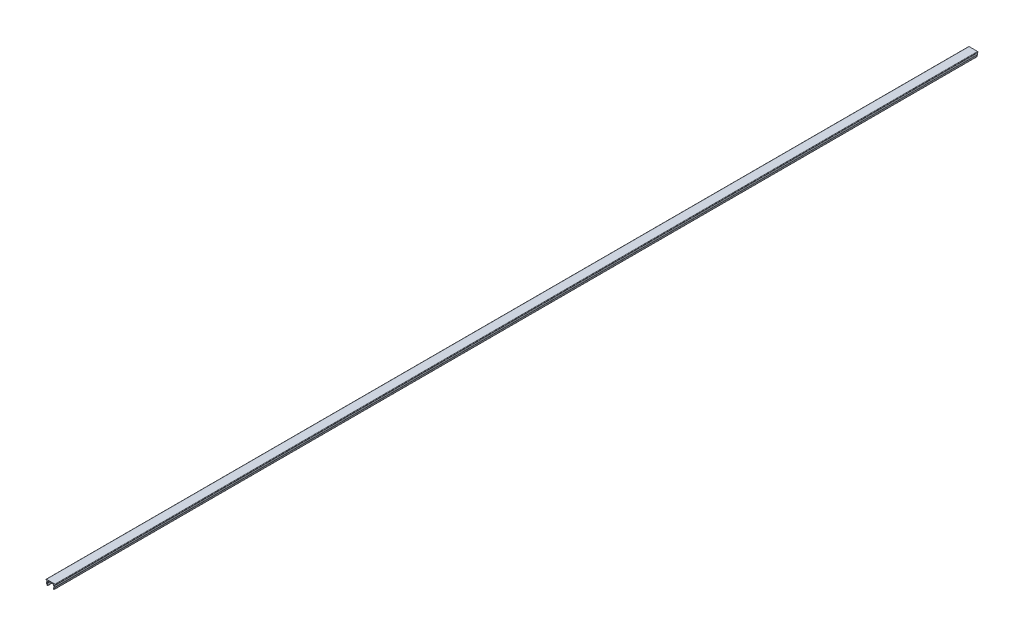
ISO-10303-21;
HEADER;
FILE_DESCRIPTION(('STEP AP214'),'2;1');
FILE_NAME('part.step','',(''),(''),'','','');
FILE_SCHEMA(('AUTOMOTIVE_DESIGN { 1 0 10303 214 1 1 1 1 }'));
ENDSEC;
DATA;
#1=APPLICATION_CONTEXT('core data for automotive mechanical design processes');
#2=APPLICATION_PROTOCOL_DEFINITION('international standard','automotive_design',2000,#1);
#3=PRODUCT_CONTEXT('',#1,'mechanical');
#4=PRODUCT('Part','Part','',(#3));
#5=PRODUCT_RELATED_PRODUCT_CATEGORY('part','',(#4));
#6=PRODUCT_DEFINITION_FORMATION('','',#4);
#7=PRODUCT_DEFINITION_CONTEXT('part definition',#1,'design');
#8=PRODUCT_DEFINITION('design','',#6,#7);
#9=PRODUCT_DEFINITION_SHAPE('','',#8);
#10=(LENGTH_UNIT() NAMED_UNIT(*) SI_UNIT(.MILLI.,.METRE.));
#11=(NAMED_UNIT(*) PLANE_ANGLE_UNIT() SI_UNIT($,.RADIAN.));
#12=(NAMED_UNIT(*) SI_UNIT($,.STERADIAN.) SOLID_ANGLE_UNIT());
#13=UNCERTAINTY_MEASURE_WITH_UNIT(LENGTH_MEASURE(1.E-05),#10,'distance_accuracy_value','');
#14=(GEOMETRIC_REPRESENTATION_CONTEXT(3) GLOBAL_UNCERTAINTY_ASSIGNED_CONTEXT((#13)) GLOBAL_UNIT_ASSIGNED_CONTEXT((#10,
#11,#12)) REPRESENTATION_CONTEXT('',''));
#15=CARTESIAN_POINT('',(0.,0.,0.));
#16=DIRECTION('',(0.,0.,1.));
#17=DIRECTION('',(1.,0.,0.));
#18=AXIS2_PLACEMENT_3D('',#15,#16,#17);
#19=CARTESIAN_POINT('',(-4.2791224628565,-0.043197798720614,501.003755708041));
#20=DIRECTION('',(0.,1.,0.));
#21=DIRECTION('',(-1.,0.,0.));
#22=AXIS2_PLACEMENT_3D('',#19,#20,#21);
#23=PLANE('',#22);
#24=DIRECTION('',(1.,0.,0.));
#25=VECTOR('',#24,1.);
#26=CARTESIAN_POINT('',(-4.2791224628565,-0.043197798720614,-498.996244291959));
#27=LINE('',#26,#25);
#28=CARTESIAN_POINT('',(-1.87810690171237,-0.043197798720614,-498.996244291959));
#29=VERTEX_POINT('',#28);
#30=CARTESIAN_POINT('',(3.46986197599936,-0.0431977987206131,-498.996244291959));
#31=VERTEX_POINT('',#30);
#32=EDGE_CURVE('E203',#29,#31,#27,.T.);
#33=ORIENTED_EDGE('',*,*,#32,.T.);
#34=DIRECTION('',(0.,0.,-1.));
#35=VECTOR('',#34,1.);
#36=CARTESIAN_POINT('',(3.46986197599936,-0.0431977987206131,501.003755708041));
#37=LINE('',#36,#35);
#38=CARTESIAN_POINT('',(3.46986197599936,-0.0431977987206131,501.003755708041));
#39=VERTEX_POINT('',#38);
#40=EDGE_CURVE('E245',#31,#39,#37,.F.);
#41=ORIENTED_EDGE('',*,*,#40,.T.);
#42=DIRECTION('',(1.,0.,0.));
#43=VECTOR('',#42,1.);
#44=CARTESIAN_POINT('',(-4.2791224628565,-0.043197798720614,501.003755708041));
#45=LINE('',#44,#43);
#46=CARTESIAN_POINT('',(-1.87810690171237,-0.043197798720614,501.003755708041));
#47=VERTEX_POINT('',#46);
#48=EDGE_CURVE('E232',#47,#39,#45,.T.);
#49=ORIENTED_EDGE('',*,*,#48,.F.);
#50=DIRECTION('',(0.,0.,-1.));
#51=VECTOR('',#50,1.);
#52=CARTESIAN_POINT('',(-1.87810690171237,-0.043197798720614,501.003755708041));
#53=LINE('',#52,#51);
#54=EDGE_CURVE('E242',#47,#29,#53,.T.);
#55=ORIENTED_EDGE('',*,*,#54,.T.);
#56=EDGE_LOOP('',(#33,#41,#49,#55));
#57=FACE_BOUND('',#56,.T.);
#58=ADVANCED_FACE('F16',(#57),#23,.F.);
#59=CARTESIAN_POINT('',(-3.7791224628565,-0.043197798720614,501.003755708041));
#60=VERTEX_POINT('',#59);
#61=CARTESIAN_POINT('',(-3.30943793573626,-0.043197798720614,501.003755708041));
#62=VERTEX_POINT('',#61);
#63=EDGE_CURVE('E230',#60,#62,#45,.T.);
#64=ORIENTED_EDGE('',*,*,#63,.F.);
#65=DIRECTION('',(0.,0.,-1.));
#66=VECTOR('',#65,1.);
#67=CARTESIAN_POINT('',(-3.7791224628565,-0.043197798720614,-498.996244291959));
#68=LINE('',#67,#66);
#69=CARTESIAN_POINT('',(-3.7791224628565,-0.043197798720614,-498.996244291959));
#70=VERTEX_POINT('',#69);
#71=EDGE_CURVE('E198',#60,#70,#68,.T.);
#72=ORIENTED_EDGE('',*,*,#71,.T.);
#73=CARTESIAN_POINT('',(-3.30943793573626,-0.043197798720614,-498.996244291959));
#74=VERTEX_POINT('',#73);
#75=EDGE_CURVE('E191',#70,#74,#27,.T.);
#76=ORIENTED_EDGE('',*,*,#75,.T.);
#77=DIRECTION('',(0.,0.,-1.));
#78=VECTOR('',#77,1.);
#79=CARTESIAN_POINT('',(-3.30943793573626,-0.043197798720614,501.003755708041));
#80=LINE('',#79,#78);
#81=EDGE_CURVE('E195',#62,#74,#80,.T.);
#82=ORIENTED_EDGE('',*,*,#81,.F.);
#83=EDGE_LOOP('',(#64,#72,#76,#82));
#84=FACE_BOUND('',#83,.T.);
#85=ADVANCED_FACE('F194',(#84),#23,.F.);
#86=CARTESIAN_POINT('',(4.90119301002326,-0.0431977987206131,-498.996244291959));
#87=VERTEX_POINT('',#86);
#88=CARTESIAN_POINT('',(5.3708775371435,-0.0431977987206131,-498.996244291959));
#89=VERTEX_POINT('',#88);
#90=EDGE_CURVE('E205',#87,#89,#27,.T.);
#91=ORIENTED_EDGE('',*,*,#90,.T.);
#92=DIRECTION('',(0.,0.,-1.));
#93=VECTOR('',#92,1.);
#94=CARTESIAN_POINT('',(5.3708775371435,-0.0431977987206131,501.003755708041));
#95=LINE('',#94,#93);
#96=CARTESIAN_POINT('',(5.3708775371435,-0.0431977987206131,501.003755708041));
#97=VERTEX_POINT('',#96);
#98=EDGE_CURVE('E320',#89,#97,#95,.F.);
#99=ORIENTED_EDGE('',*,*,#98,.T.);
#100=CARTESIAN_POINT('',(4.90119301002326,-0.0431977987206131,501.003755708041));
#101=VERTEX_POINT('',#100);
#102=EDGE_CURVE('E233',#101,#97,#45,.T.);
#103=ORIENTED_EDGE('',*,*,#102,.F.);
#104=DIRECTION('',(0.,0.,-1.));
#105=VECTOR('',#104,1.);
#106=CARTESIAN_POINT('',(4.90119301002326,-0.0431977987206131,501.003755708041));
#107=LINE('',#106,#105);
#108=EDGE_CURVE('E410',#101,#87,#107,.T.);
#109=ORIENTED_EDGE('',*,*,#108,.T.);
#110=EDGE_LOOP('',(#91,#99,#103,#109));
#111=FACE_BOUND('',#110,.T.);
#112=ADVANCED_FACE('F371',(#111),#23,.F.);
#113=CARTESIAN_POINT('',(-4.2791224628565,0.956802201279387,501.003755708041));
#114=DIRECTION('',(0.,1.,0.));
#115=DIRECTION('',(-1.,0.,0.));
#116=AXIS2_PLACEMENT_3D('',#113,#114,#115);
#117=PLANE('',#116);
#118=DIRECTION('',(1.,0.,0.));
#119=VECTOR('',#118,1.);
#120=CARTESIAN_POINT('',(-4.2791224628565,0.956802201279387,501.003755708041));
#121=LINE('',#120,#119);
#122=CARTESIAN_POINT('',(-3.7791224628565,0.956802201279387,501.003755708041));
#123=VERTEX_POINT('',#122);
#124=CARTESIAN_POINT('',(5.3708775371435,0.956802201279388,501.003755708041));
#125=VERTEX_POINT('',#124);
#126=EDGE_CURVE('E214',#123,#125,#121,.T.);
#127=ORIENTED_EDGE('',*,*,#126,.T.);
#128=DIRECTION('',(0.,0.,-1.));
#129=VECTOR('',#128,1.);
#130=CARTESIAN_POINT('',(5.3708775371435,0.956802201279388,501.003755708041));
#131=LINE('',#130,#129);
#132=CARTESIAN_POINT('',(5.3708775371435,0.956802201279388,-498.996244291959));
#133=VERTEX_POINT('',#132);
#134=EDGE_CURVE('E317',#125,#133,#131,.T.);
#135=ORIENTED_EDGE('',*,*,#134,.T.);
#136=DIRECTION('',(1.,0.,0.));
#137=VECTOR('',#136,1.);
#138=CARTESIAN_POINT('',(-4.2791224628565,0.956802201279387,-498.996244291959));
#139=LINE('',#138,#137);
#140=CARTESIAN_POINT('',(-3.7791224628565,0.956802201279387,-498.996244291959));
#141=VERTEX_POINT('',#140);
#142=EDGE_CURVE('E202',#141,#133,#139,.T.);
#143=ORIENTED_EDGE('',*,*,#142,.F.);
#144=DIRECTION('',(0.,0.,-1.));
#145=VECTOR('',#144,1.);
#146=CARTESIAN_POINT('',(-3.7791224628565,0.956802201279387,501.003755708041));
#147=LINE('',#146,#145);
#148=EDGE_CURVE('E314',#141,#123,#147,.F.);
#149=ORIENTED_EDGE('',*,*,#148,.T.);
#150=EDGE_LOOP('',(#127,#135,#143,#149));
#151=FACE_BOUND('',#150,.T.);
#152=ADVANCED_FACE('F359',(#151),#117,.T.);
#153=CARTESIAN_POINT('',(-2.07578383767053,-4.79319764352417,501.003755708041));
#154=DIRECTION('',(0.,0.,-1.));
#155=DIRECTION('',(-1.,0.,0.));
#156=AXIS2_PLACEMENT_3D('',#153,#154,#155);
#157=PLANE('',#156);
#158=DIRECTION('',(0.230433167257532,-0.973088153985888,0.));
#159=VECTOR('',#158,1.);
#160=CARTESIAN_POINT('',(-3.69066653984945,-2.25841438234938,501.003755708041));
#161=LINE('',#160,#159);
#162=CARTESIAN_POINT('',(-3.69066653984945,-2.25841438234938,501.003755708041));
#163=VERTEX_POINT('',#162);
#164=CARTESIAN_POINT('',(-3.23754859062756,-4.17187030535644,501.003755708041));
#165=VERTEX_POINT('',#164);
#166=EDGE_CURVE('E219',#163,#165,#161,.T.);
#167=ORIENTED_EDGE('',*,*,#166,.T.);
#168=CARTESIAN_POINT('',(-2.75100451363461,-4.05665372172767,501.003755708041));
#169=DIRECTION('',(0.,0.,-1.));
#170=DIRECTION('',(-1.,0.,0.));
#171=AXIS2_PLACEMENT_3D('',#168,#169,#170);
#172=CIRCLE('',#171,0.5);
#173=CARTESIAN_POINT('',(-2.63578793000585,-4.54319779872061,501.003755708041));
#174=VERTEX_POINT('',#173);
#175=EDGE_CURVE('E294',#165,#174,#172,.F.);
#176=ORIENTED_EDGE('',*,*,#175,.T.);
#177=CARTESIAN_POINT('',(-2.75100451363461,-4.05665372172767,501.003755708041));
#178=DIRECTION('',(0.,0.,-1.));
#179=DIRECTION('',(-1.,0.,0.));
#180=AXIS2_PLACEMENT_3D('',#177,#178,#179);
#181=CIRCLE('',#180,0.5);
#182=CARTESIAN_POINT('',(-2.26446043664167,-3.9414371380989,501.003755708041));
#183=VERTEX_POINT('',#182);
#184=EDGE_CURVE('E33',#174,#183,#181,.F.);
#185=ORIENTED_EDGE('',*,*,#184,.T.);
#186=DIRECTION('',(0.230433167257532,-0.973088153985888,0.));
#187=VECTOR('',#186,1.);
#188=CARTESIAN_POINT('',(-2.71757838586356,-2.02798121509185,501.003755708041));
#189=LINE('',#188,#187);
#190=CARTESIAN_POINT('',(-2.66816075278754,-2.23666520757697,501.003755708041));
#191=VERTEX_POINT('',#190);
#192=EDGE_CURVE('E223',#191,#183,#189,.T.);
#193=ORIENTED_EDGE('',*,*,#192,.F.);
#194=CARTESIAN_POINT('',(-2.1816166757946,-2.1214486239482,501.003755708041));
#195=DIRECTION('',(0.,0.,-1.));
#196=DIRECTION('',(-1.,0.,0.));
#197=AXIS2_PLACEMENT_3D('',#194,#195,#196);
#198=CIRCLE('',#197,0.5);
#199=CARTESIAN_POINT('',(-2.67261989928492,-2.02702492712314,501.003755708041));
#200=VERTEX_POINT('',#199);
#201=EDGE_CURVE('E10',#191,#200,#198,.T.);
#202=ORIENTED_EDGE('',*,*,#201,.T.);
#203=DIRECTION('',(-0.188847393650124,-0.982006446980647,0.));
#204=VECTOR('',#203,1.);
#205=CARTESIAN_POINT('',(-2.21311923936618,0.362378504454324,501.003755708041));
#206=LINE('',#205,#204);
#207=CARTESIAN_POINT('',(-2.36911012520269,-0.448774101895553,501.003755708041));
#208=VERTEX_POINT('',#207);
#209=EDGE_CURVE('E414',#208,#200,#206,.T.);
#210=ORIENTED_EDGE('',*,*,#209,.F.);
#211=CARTESIAN_POINT('',(-1.87810690171237,-0.543197798720614,501.003755708041));
#212=DIRECTION('',(0.,0.,-1.));
#213=DIRECTION('',(-1.,0.,0.));
#214=AXIS2_PLACEMENT_3D('',#211,#212,#213);
#215=CIRCLE('',#214,0.5);
#216=EDGE_CURVE('E329',#208,#47,#215,.T.);
#217=ORIENTED_EDGE('',*,*,#216,.T.);
#218=ORIENTED_EDGE('',*,*,#48,.T.);
#219=CARTESIAN_POINT('',(3.46986197599936,-0.543197798720614,501.003755708041));
#220=DIRECTION('',(0.,0.,-1.));
#221=DIRECTION('',(-1.,0.,0.));
#222=AXIS2_PLACEMENT_3D('',#219,#220,#221);
#223=CIRCLE('',#222,0.5);
#224=CARTESIAN_POINT('',(3.96086519948969,-0.448774101895551,501.003755708041));
#225=VERTEX_POINT('',#224);
#226=EDGE_CURVE('E325',#39,#225,#223,.T.);
#227=ORIENTED_EDGE('',*,*,#226,.T.);
#228=DIRECTION('',(0.188847393650125,-0.982006446980647,0.));
#229=VECTOR('',#228,1.);
#230=CARTESIAN_POINT('',(3.80487431365317,0.362378504454324,501.003755708041));
#231=LINE('',#230,#229);
#232=CARTESIAN_POINT('',(4.26437497357192,-2.02702492712314,501.003755708041));
#233=VERTEX_POINT('',#232);
#234=EDGE_CURVE('E395',#225,#233,#231,.T.);
#235=ORIENTED_EDGE('',*,*,#234,.T.);
#236=CARTESIAN_POINT('',(3.77337175008159,-2.1214486239482,501.003755708041));
#237=DIRECTION('',(0.,0.,-1.));
#238=DIRECTION('',(-1.,0.,0.));
#239=AXIS2_PLACEMENT_3D('',#236,#237,#238);
#240=CIRCLE('',#239,0.5);
#241=CARTESIAN_POINT('',(4.25991582707454,-2.23666520757697,501.003755708041));
#242=VERTEX_POINT('',#241);
#243=EDGE_CURVE('E333',#233,#242,#240,.T.);
#244=ORIENTED_EDGE('',*,*,#243,.T.);
#245=DIRECTION('',(-0.230433167257532,-0.973088153985888,0.));
#246=VECTOR('',#245,1.);
#247=CARTESIAN_POINT('',(4.30933346015055,-2.02798121509185,501.003755708041));
#248=LINE('',#247,#246);
#249=CARTESIAN_POINT('',(3.85621551092866,-3.9414371380989,501.003755708041));
#250=VERTEX_POINT('',#249);
#251=EDGE_CURVE('E399',#242,#250,#248,.T.);
#252=ORIENTED_EDGE('',*,*,#251,.T.);
#253=CARTESIAN_POINT('',(4.34275958792161,-4.05665372172767,501.003755708041));
#254=DIRECTION('',(0.,0.,-1.));
#255=DIRECTION('',(-1.,0.,0.));
#256=AXIS2_PLACEMENT_3D('',#253,#254,#255);
#257=CIRCLE('',#256,0.5);
#258=CARTESIAN_POINT('',(4.22754300429284,-4.54319779872061,501.003755708041));
#259=VERTEX_POINT('',#258);
#260=EDGE_CURVE('E289',#250,#259,#257,.F.);
#261=ORIENTED_EDGE('',*,*,#260,.T.);
#262=CARTESIAN_POINT('',(4.34275958792161,-4.05665372172767,501.003755708041));
#263=DIRECTION('',(0.,0.,-1.));
#264=DIRECTION('',(-1.,0.,0.));
#265=AXIS2_PLACEMENT_3D('',#262,#263,#264);
#266=CIRCLE('',#265,0.5);
#267=CARTESIAN_POINT('',(4.82930366491455,-4.17187030535643,501.003755708041));
#268=VERTEX_POINT('',#267);
#269=EDGE_CURVE('E291',#259,#268,#266,.F.);
#270=ORIENTED_EDGE('',*,*,#269,.T.);
#271=DIRECTION('',(-0.230433167257532,-0.973088153985888,0.));
#272=VECTOR('',#271,1.);
#273=CARTESIAN_POINT('',(5.28242161413644,-2.25841438234938,501.003755708041));
#274=LINE('',#273,#272);
#275=CARTESIAN_POINT('',(5.28242161413644,-2.25841438234938,501.003755708041));
#276=VERTEX_POINT('',#275);
#277=EDGE_CURVE('E403',#276,#268,#274,.T.);
#278=ORIENTED_EDGE('',*,*,#277,.F.);
#279=CARTESIAN_POINT('',(4.7958775371435,-2.14319779872061,501.003755708041));
#280=DIRECTION('',(0.,0.,-1.));
#281=DIRECTION('',(-1.,0.,0.));
#282=AXIS2_PLACEMENT_3D('',#279,#280,#281);
#283=CIRCLE('',#282,0.5);
#284=CARTESIAN_POINT('',(5.28688076063382,-2.04877410189555,501.003755708041));
#285=VERTEX_POINT('',#284);
#286=EDGE_CURVE('E285',#276,#285,#283,.F.);
#287=ORIENTED_EDGE('',*,*,#286,.T.);
#288=DIRECTION('',(0.188847393650125,-0.982006446980647,0.));
#289=VECTOR('',#288,1.);
#290=CARTESIAN_POINT('',(4.78688076063382,0.551225898104449,501.003755708041));
#291=LINE('',#290,#289);
#292=EDGE_CURVE('E375',#101,#285,#291,.T.);
#293=ORIENTED_EDGE('',*,*,#292,.F.);
#294=ORIENTED_EDGE('',*,*,#102,.T.);
#295=CARTESIAN_POINT('',(5.3708775371435,0.456802201279387,501.003755708041));
#296=DIRECTION('',(0.,0.,-1.));
#297=DIRECTION('',(-1.,0.,0.));
#298=AXIS2_PLACEMENT_3D('',#295,#296,#297);
#299=CIRCLE('',#298,0.5);
#300=CARTESIAN_POINT('',(5.8708775371435,0.456802201279387,501.003755708041));
#301=VERTEX_POINT('',#300);
#302=EDGE_CURVE('E281',#97,#301,#299,.F.);
#303=ORIENTED_EDGE('',*,*,#302,.T.);
#304=CARTESIAN_POINT('',(5.3708775371435,0.456802201279387,501.003755708041));
#305=DIRECTION('',(0.,0.,-1.));
#306=DIRECTION('',(-1.,0.,0.));
#307=AXIS2_PLACEMENT_3D('',#304,#305,#306);
#308=CIRCLE('',#307,0.5);
#309=EDGE_CURVE('E283',#301,#125,#308,.F.);
#310=ORIENTED_EDGE('',*,*,#309,.T.);
#311=ORIENTED_EDGE('',*,*,#126,.F.);
#312=CARTESIAN_POINT('',(-3.7791224628565,0.456802201279386,501.003755708041));
#313=DIRECTION('',(0.,0.,-1.));
#314=DIRECTION('',(-1.,0.,0.));
#315=AXIS2_PLACEMENT_3D('',#312,#313,#314);
#316=CIRCLE('',#315,0.5);
#317=CARTESIAN_POINT('',(-4.2791224628565,0.456802201279386,501.003755708041));
#318=VERTEX_POINT('',#317);
#319=EDGE_CURVE('E279',#123,#318,#316,.F.);
#320=ORIENTED_EDGE('',*,*,#319,.T.);
#321=CARTESIAN_POINT('',(-3.7791224628565,0.456802201279386,501.003755708041));
#322=DIRECTION('',(0.,0.,-1.));
#323=DIRECTION('',(-1.,0.,0.));
#324=AXIS2_PLACEMENT_3D('',#321,#322,#323);
#325=CIRCLE('',#324,0.5);
#326=EDGE_CURVE('E277',#318,#60,#325,.F.);
#327=ORIENTED_EDGE('',*,*,#326,.T.);
#328=ORIENTED_EDGE('',*,*,#63,.T.);
#329=DIRECTION('',(-0.188847393650124,-0.982006446980647,0.));
#330=VECTOR('',#329,1.);
#331=CARTESIAN_POINT('',(-3.19512568634683,0.551225898104447,501.003755708041));
#332=LINE('',#331,#330);
#333=CARTESIAN_POINT('',(-3.69512568634683,-2.04877410189555,501.003755708041));
#334=VERTEX_POINT('',#333);
#335=EDGE_CURVE('E212',#62,#334,#332,.T.);
#336=ORIENTED_EDGE('',*,*,#335,.T.);
#337=CARTESIAN_POINT('',(-3.2041224628565,-2.14319779872061,501.003755708041));
#338=DIRECTION('',(0.,0.,-1.));
#339=DIRECTION('',(-1.,0.,0.));
#340=AXIS2_PLACEMENT_3D('',#337,#338,#339);
#341=CIRCLE('',#340,0.5);
#342=EDGE_CURVE('E287',#334,#163,#341,.F.);
#343=ORIENTED_EDGE('',*,*,#342,.T.);
#344=EDGE_LOOP('',(#167,#176,#185,#193,#202,#210,#217,#218,#227,#235,#244,#252,#261,#270,#278,
#287,#293,#294,#303,#310,#311,#320,#327,#328,#336,#343));
#345=FACE_BOUND('',#344,.T.);
#346=ADVANCED_FACE('F355',(#345),#157,.F.);
#347=CARTESIAN_POINT('',(-2.07578383767053,-4.79319764352417,-498.996244291959));
#348=DIRECTION('',(0.,0.,-1.));
#349=DIRECTION('',(-1.,0.,0.));
#350=AXIS2_PLACEMENT_3D('',#347,#348,#349);
#351=PLANE('',#350);
#352=CARTESIAN_POINT('',(-2.75100451363461,-4.05665372172767,-498.996244291959));
#353=DIRECTION('',(0.,0.,-1.));
#354=DIRECTION('',(-1.,0.,0.));
#355=AXIS2_PLACEMENT_3D('',#352,#353,#354);
#356=CIRCLE('',#355,0.5);
#357=CARTESIAN_POINT('',(-2.26446043664167,-3.9414371380989,-498.996244291959));
#358=VERTEX_POINT('',#357);
#359=CARTESIAN_POINT('',(-2.63578793000585,-4.54319779872061,-498.996244291959));
#360=VERTEX_POINT('',#359);
#361=EDGE_CURVE('E267',#358,#360,#356,.T.);
#362=ORIENTED_EDGE('',*,*,#361,.T.);
#363=CARTESIAN_POINT('',(-2.75100451363461,-4.05665372172767,-498.996244291959));
#364=DIRECTION('',(0.,0.,-1.));
#365=DIRECTION('',(-1.,0.,0.));
#366=AXIS2_PLACEMENT_3D('',#363,#364,#365);
#367=CIRCLE('',#366,0.5);
#368=CARTESIAN_POINT('',(-3.23754859062756,-4.17187030535644,-498.996244291959));
#369=VERTEX_POINT('',#368);
#370=EDGE_CURVE('E269',#360,#369,#367,.T.);
#371=ORIENTED_EDGE('',*,*,#370,.T.);
#372=DIRECTION('',(0.230433167257532,-0.973088153985888,0.));
#373=VECTOR('',#372,1.);
#374=CARTESIAN_POINT('',(-3.69066653984945,-2.25841438234938,-498.996244291959));
#375=LINE('',#374,#373);
#376=CARTESIAN_POINT('',(-3.69066653984945,-2.25841438234938,-498.996244291959));
#377=VERTEX_POINT('',#376);
#378=EDGE_CURVE('E411',#377,#369,#375,.T.);
#379=ORIENTED_EDGE('',*,*,#378,.F.);
#380=CARTESIAN_POINT('',(-3.2041224628565,-2.14319779872061,-498.996244291959));
#381=DIRECTION('',(0.,0.,-1.));
#382=DIRECTION('',(-1.,0.,0.));
#383=AXIS2_PLACEMENT_3D('',#380,#381,#382);
#384=CIRCLE('',#383,0.5);
#385=CARTESIAN_POINT('',(-3.69512568634683,-2.04877410189555,-498.996244291959));
#386=VERTEX_POINT('',#385);
#387=EDGE_CURVE('E218',#377,#386,#384,.T.);
#388=ORIENTED_EDGE('',*,*,#387,.T.);
#389=DIRECTION('',(-0.188847393650124,-0.982006446980647,0.));
#390=VECTOR('',#389,1.);
#391=CARTESIAN_POINT('',(-3.19512568634683,0.551225898104447,-498.996244291959));
#392=LINE('',#391,#390);
#393=EDGE_CURVE('E209',#74,#386,#392,.T.);
#394=ORIENTED_EDGE('',*,*,#393,.F.);
#395=ORIENTED_EDGE('',*,*,#75,.F.);
#396=CARTESIAN_POINT('',(-3.7791224628565,0.456802201279386,-498.996244291959));
#397=DIRECTION('',(0.,0.,-1.));
#398=DIRECTION('',(-1.,0.,0.));
#399=AXIS2_PLACEMENT_3D('',#396,#397,#398);
#400=CIRCLE('',#399,0.5);
#401=CARTESIAN_POINT('',(-4.2791224628565,0.456802201279386,-498.996244291959));
#402=VERTEX_POINT('',#401);
#403=EDGE_CURVE('E252',#70,#402,#400,.T.);
#404=ORIENTED_EDGE('',*,*,#403,.T.);
#405=CARTESIAN_POINT('',(-3.7791224628565,0.456802201279386,-498.996244291959));
#406=DIRECTION('',(0.,0.,-1.));
#407=DIRECTION('',(-1.,0.,0.));
#408=AXIS2_PLACEMENT_3D('',#405,#406,#407);
#409=CIRCLE('',#408,0.5);
#410=EDGE_CURVE('E254',#402,#141,#409,.T.);
#411=ORIENTED_EDGE('',*,*,#410,.T.);
#412=ORIENTED_EDGE('',*,*,#142,.T.);
#413=CARTESIAN_POINT('',(5.3708775371435,0.456802201279387,-498.996244291959));
#414=DIRECTION('',(0.,0.,-1.));
#415=DIRECTION('',(-1.,0.,0.));
#416=AXIS2_PLACEMENT_3D('',#413,#414,#415);
#417=CIRCLE('',#416,0.5);
#418=CARTESIAN_POINT('',(5.8708775371435,0.456802201279387,-498.996244291959));
#419=VERTEX_POINT('',#418);
#420=EDGE_CURVE('E258',#133,#419,#417,.T.);
#421=ORIENTED_EDGE('',*,*,#420,.T.);
#422=CARTESIAN_POINT('',(5.3708775371435,0.456802201279387,-498.996244291959));
#423=DIRECTION('',(0.,0.,-1.));
#424=DIRECTION('',(-1.,0.,0.));
#425=AXIS2_PLACEMENT_3D('',#422,#423,#424);
#426=CIRCLE('',#425,0.5);
#427=EDGE_CURVE('E256',#419,#89,#426,.T.);
#428=ORIENTED_EDGE('',*,*,#427,.T.);
#429=ORIENTED_EDGE('',*,*,#90,.F.);
#430=DIRECTION('',(0.188847393650125,-0.982006446980647,0.));
#431=VECTOR('',#430,1.);
#432=CARTESIAN_POINT('',(4.78688076063382,0.551225898104449,-498.996244291959));
#433=LINE('',#432,#431);
#434=CARTESIAN_POINT('',(5.28688076063382,-2.04877410189555,-498.996244291959));
#435=VERTEX_POINT('',#434);
#436=EDGE_CURVE('E400',#87,#435,#433,.T.);
#437=ORIENTED_EDGE('',*,*,#436,.T.);
#438=CARTESIAN_POINT('',(4.7958775371435,-2.14319779872061,-498.996244291959));
#439=DIRECTION('',(0.,0.,-1.));
#440=DIRECTION('',(-1.,0.,0.));
#441=AXIS2_PLACEMENT_3D('',#438,#439,#440);
#442=CIRCLE('',#441,0.5);
#443=CARTESIAN_POINT('',(5.28242161413644,-2.25841438234938,-498.996244291959));
#444=VERTEX_POINT('',#443);
#445=EDGE_CURVE('E260',#435,#444,#442,.T.);
#446=ORIENTED_EDGE('',*,*,#445,.T.);
#447=DIRECTION('',(-0.230433167257532,-0.973088153985888,0.));
#448=VECTOR('',#447,1.);
#449=CARTESIAN_POINT('',(5.28242161413644,-2.25841438234938,-498.996244291959));
#450=LINE('',#449,#448);
#451=CARTESIAN_POINT('',(4.82930366491455,-4.17187030535643,-498.996244291959));
#452=VERTEX_POINT('',#451);
#453=EDGE_CURVE('E406',#444,#452,#450,.T.);
#454=ORIENTED_EDGE('',*,*,#453,.T.);
#455=CARTESIAN_POINT('',(4.34275958792161,-4.05665372172767,-498.996244291959));
#456=DIRECTION('',(0.,0.,-1.));
#457=DIRECTION('',(-1.,0.,0.));
#458=AXIS2_PLACEMENT_3D('',#455,#456,#457);
#459=CIRCLE('',#458,0.5);
#460=CARTESIAN_POINT('',(4.22754300429284,-4.54319779872061,-498.996244291959));
#461=VERTEX_POINT('',#460);
#462=EDGE_CURVE('E265',#452,#461,#459,.T.);
#463=ORIENTED_EDGE('',*,*,#462,.T.);
#464=CARTESIAN_POINT('',(4.34275958792161,-4.05665372172767,-498.996244291959));
#465=DIRECTION('',(0.,0.,-1.));
#466=DIRECTION('',(-1.,0.,0.));
#467=AXIS2_PLACEMENT_3D('',#464,#465,#466);
#468=CIRCLE('',#467,0.5);
#469=CARTESIAN_POINT('',(3.85621551092866,-3.9414371380989,-498.996244291959));
#470=VERTEX_POINT('',#469);
#471=EDGE_CURVE('E263',#461,#470,#468,.T.);
#472=ORIENTED_EDGE('',*,*,#471,.T.);
#473=DIRECTION('',(-0.230433167257532,-0.973088153985888,0.));
#474=VECTOR('',#473,1.);
#475=CARTESIAN_POINT('',(4.30933346015055,-2.02798121509185,-498.996244291959));
#476=LINE('',#475,#474);
#477=CARTESIAN_POINT('',(4.25991582707454,-2.23666520757697,-498.996244291959));
#478=VERTEX_POINT('',#477);
#479=EDGE_CURVE('E339',#478,#470,#476,.T.);
#480=ORIENTED_EDGE('',*,*,#479,.F.);
#481=CARTESIAN_POINT('',(3.77337175008159,-2.1214486239482,-498.996244291959));
#482=DIRECTION('',(0.,0.,-1.));
#483=DIRECTION('',(-1.,0.,0.));
#484=AXIS2_PLACEMENT_3D('',#481,#482,#483);
#485=CIRCLE('',#484,0.5);
#486=CARTESIAN_POINT('',(4.26437497357192,-2.02702492712314,-498.996244291959));
#487=VERTEX_POINT('',#486);
#488=EDGE_CURVE('E331',#478,#487,#485,.F.);
#489=ORIENTED_EDGE('',*,*,#488,.T.);
#490=DIRECTION('',(0.188847393650125,-0.982006446980647,0.));
#491=VECTOR('',#490,1.);
#492=CARTESIAN_POINT('',(3.80487431365317,0.362378504454324,-498.996244291959));
#493=LINE('',#492,#491);
#494=CARTESIAN_POINT('',(3.96086519948969,-0.448774101895551,-498.996244291959));
#495=VERTEX_POINT('',#494);
#496=EDGE_CURVE('E393',#495,#487,#493,.T.);
#497=ORIENTED_EDGE('',*,*,#496,.F.);
#498=CARTESIAN_POINT('',(3.46986197599936,-0.543197798720614,-498.996244291959));
#499=DIRECTION('',(0.,0.,-1.));
#500=DIRECTION('',(-1.,0.,0.));
#501=AXIS2_PLACEMENT_3D('',#498,#499,#500);
#502=CIRCLE('',#501,0.5);
#503=EDGE_CURVE('E323',#495,#31,#502,.F.);
#504=ORIENTED_EDGE('',*,*,#503,.T.);
#505=ORIENTED_EDGE('',*,*,#32,.F.);
#506=CARTESIAN_POINT('',(-1.87810690171237,-0.543197798720614,-498.996244291959));
#507=DIRECTION('',(0.,0.,-1.));
#508=DIRECTION('',(-1.,0.,0.));
#509=AXIS2_PLACEMENT_3D('',#506,#507,#508);
#510=CIRCLE('',#509,0.5);
#511=CARTESIAN_POINT('',(-2.36911012520269,-0.448774101895553,-498.996244291959));
#512=VERTEX_POINT('',#511);
#513=EDGE_CURVE('E327',#29,#512,#510,.F.);
#514=ORIENTED_EDGE('',*,*,#513,.T.);
#515=DIRECTION('',(-0.188847393650124,-0.982006446980647,0.));
#516=VECTOR('',#515,1.);
#517=CARTESIAN_POINT('',(-2.21311923936618,0.362378504454324,-498.996244291959));
#518=LINE('',#517,#516);
#519=CARTESIAN_POINT('',(-2.67261989928492,-2.02702492712314,-498.996244291959));
#520=VERTEX_POINT('',#519);
#521=EDGE_CURVE('E220',#512,#520,#518,.T.);
#522=ORIENTED_EDGE('',*,*,#521,.T.);
#523=CARTESIAN_POINT('',(-2.1816166757946,-2.1214486239482,-498.996244291959));
#524=DIRECTION('',(0.,0.,-1.));
#525=DIRECTION('',(-1.,0.,0.));
#526=AXIS2_PLACEMENT_3D('',#523,#524,#525);
#527=CIRCLE('',#526,0.5);
#528=CARTESIAN_POINT('',(-2.66816075278754,-2.23666520757697,-498.996244291959));
#529=VERTEX_POINT('',#528);
#530=EDGE_CURVE('E25',#520,#529,#527,.F.);
#531=ORIENTED_EDGE('',*,*,#530,.T.);
#532=DIRECTION('',(0.230433167257532,-0.973088153985888,0.));
#533=VECTOR('',#532,1.);
#534=CARTESIAN_POINT('',(-2.71757838586356,-2.02798121509185,-498.996244291959));
#535=LINE('',#534,#533);
#536=EDGE_CURVE('E226',#529,#358,#535,.T.);
#537=ORIENTED_EDGE('',*,*,#536,.T.);
#538=EDGE_LOOP('',(#362,#371,#379,#388,#394,#395,#404,#411,#412,#421,#428,#429,#437,#446,#454,
#463,#472,#480,#489,#497,#504,#505,#514,#522,#531,#537));
#539=FACE_BOUND('',#538,.T.);
#540=ADVANCED_FACE('F216',(#539),#351,.T.);
#541=CARTESIAN_POINT('',(-2.21311923936618,0.362378504454324,501.003755708041));
#542=DIRECTION('',(0.982006446980648,-0.188847393650124,0.));
#543=DIRECTION('',(0.188847393650124,0.982006446980647,0.));
#544=AXIS2_PLACEMENT_3D('',#541,#542,#543);
#545=PLANE('',#544);
#546=ORIENTED_EDGE('',*,*,#521,.F.);
#547=DIRECTION('',(0.,0.,-1.));
#548=VECTOR('',#547,1.);
#549=CARTESIAN_POINT('',(-2.36911012520269,-0.448774101895553,501.003755708041));
#550=LINE('',#549,#548);
#551=EDGE_CURVE('E250',#512,#208,#550,.F.);
#552=ORIENTED_EDGE('',*,*,#551,.T.);
#553=ORIENTED_EDGE('',*,*,#209,.T.);
#554=DIRECTION('',(0.,0.,-1.));
#555=VECTOR('',#554,1.);
#556=CARTESIAN_POINT('',(-2.67261989928492,-2.02702492712314,-498.996244291959));
#557=LINE('',#556,#555);
#558=EDGE_CURVE('E247',#200,#520,#557,.T.);
#559=ORIENTED_EDGE('',*,*,#558,.T.);
#560=EDGE_LOOP('',(#546,#552,#553,#559));
#561=FACE_BOUND('',#560,.T.);
#562=ADVANCED_FACE('F467',(#561),#545,.T.);
#563=CARTESIAN_POINT('',(-3.19512568634683,0.551225898104447,501.003755708041));
#564=DIRECTION('',(0.982006446980648,-0.188847393650124,0.));
#565=DIRECTION('',(0.188847393650124,0.982006446980647,0.));
#566=AXIS2_PLACEMENT_3D('',#563,#564,#565);
#567=PLANE('',#566);
#568=ORIENTED_EDGE('',*,*,#393,.T.);
#569=DIRECTION('',(0.,0.,-1.));
#570=VECTOR('',#569,1.);
#571=CARTESIAN_POINT('',(-3.69512568634683,-2.04877410189555,501.003755708041));
#572=LINE('',#571,#570);
#573=EDGE_CURVE('E309',#386,#334,#572,.F.);
#574=ORIENTED_EDGE('',*,*,#573,.T.);
#575=ORIENTED_EDGE('',*,*,#335,.F.);
#576=ORIENTED_EDGE('',*,*,#81,.T.);
#577=EDGE_LOOP('',(#568,#574,#575,#576));
#578=FACE_BOUND('',#577,.T.);
#579=ADVANCED_FACE('F208',(#578),#567,.F.);
#580=CARTESIAN_POINT('',(-3.69066653984945,-2.25841438234938,501.003755708041));
#581=DIRECTION('',(0.973088153985888,0.230433167257532,0.));
#582=DIRECTION('',(-0.230433167257532,0.973088153985888,0.));
#583=AXIS2_PLACEMENT_3D('',#580,#581,#582);
#584=PLANE('',#583);
#585=ORIENTED_EDGE('',*,*,#378,.T.);
#586=DIRECTION('',(0.,0.,-1.));
#587=VECTOR('',#586,1.);
#588=CARTESIAN_POINT('',(-3.23754859062756,-4.17187030535644,501.003755708041));
#589=LINE('',#588,#587);
#590=EDGE_CURVE('E274',#369,#165,#589,.F.);
#591=ORIENTED_EDGE('',*,*,#590,.T.);
#592=ORIENTED_EDGE('',*,*,#166,.F.);
#593=DIRECTION('',(0.,0.,-1.));
#594=VECTOR('',#593,1.);
#595=CARTESIAN_POINT('',(-3.69066653984945,-2.25841438234938,501.003755708041));
#596=LINE('',#595,#594);
#597=EDGE_CURVE('E271',#163,#377,#596,.T.);
#598=ORIENTED_EDGE('',*,*,#597,.T.);
#599=EDGE_LOOP('',(#585,#591,#592,#598));
#600=FACE_BOUND('',#599,.T.);
#601=ADVANCED_FACE('F430',(#600),#584,.F.);
#602=CARTESIAN_POINT('',(-2.71757838586356,-2.02798121509185,501.003755708041));
#603=DIRECTION('',(0.973088153985888,0.230433167257532,0.));
#604=DIRECTION('',(-0.230433167257532,0.973088153985888,0.));
#605=AXIS2_PLACEMENT_3D('',#602,#603,#604);
#606=PLANE('',#605);
#607=ORIENTED_EDGE('',*,*,#192,.T.);
#608=DIRECTION('',(0.,0.,-1.));
#609=VECTOR('',#608,1.);
#610=CARTESIAN_POINT('',(-2.26446043664167,-3.9414371380989,501.003755708041));
#611=LINE('',#610,#609);
#612=EDGE_CURVE('E297',#183,#358,#611,.T.);
#613=ORIENTED_EDGE('',*,*,#612,.T.);
#614=ORIENTED_EDGE('',*,*,#536,.F.);
#615=DIRECTION('',(0.,0.,-1.));
#616=VECTOR('',#615,1.);
#617=CARTESIAN_POINT('',(-2.66816075278754,-2.23666520757697,501.003755708041));
#618=LINE('',#617,#616);
#619=EDGE_CURVE('E40',#529,#191,#618,.F.);
#620=ORIENTED_EDGE('',*,*,#619,.T.);
#621=EDGE_LOOP('',(#607,#613,#614,#620));
#622=FACE_BOUND('',#621,.T.);
#623=ADVANCED_FACE('F471',(#622),#606,.T.);
#624=CARTESIAN_POINT('',(4.78688076063382,0.551225898104449,501.003755708041));
#625=DIRECTION('',(0.982006446980647,0.188847393650125,0.));
#626=DIRECTION('',(-0.188847393650125,0.982006446980647,0.));
#627=AXIS2_PLACEMENT_3D('',#624,#625,#626);
#628=PLANE('',#627);
#629=ORIENTED_EDGE('',*,*,#292,.T.);
#630=DIRECTION('',(0.,0.,-1.));
#631=VECTOR('',#630,1.);
#632=CARTESIAN_POINT('',(5.28688076063382,-2.04877410189555,501.003755708041));
#633=LINE('',#632,#631);
#634=EDGE_CURVE('E311',#285,#435,#633,.T.);
#635=ORIENTED_EDGE('',*,*,#634,.T.);
#636=ORIENTED_EDGE('',*,*,#436,.F.);
#637=ORIENTED_EDGE('',*,*,#108,.F.);
#638=EDGE_LOOP('',(#629,#635,#636,#637));
#639=FACE_BOUND('',#638,.T.);
#640=ADVANCED_FACE('F474',(#639),#628,.T.);
#641=CARTESIAN_POINT('',(3.80487431365317,0.362378504454324,501.003755708041));
#642=DIRECTION('',(0.982006446980647,0.188847393650125,0.));
#643=DIRECTION('',(-0.188847393650125,0.982006446980647,0.));
#644=AXIS2_PLACEMENT_3D('',#641,#642,#643);
#645=PLANE('',#644);
#646=ORIENTED_EDGE('',*,*,#234,.F.);
#647=DIRECTION('',(0.,0.,-1.));
#648=VECTOR('',#647,1.);
#649=CARTESIAN_POINT('',(3.96086519948969,-0.448774101895551,-498.996244291959));
#650=LINE('',#649,#648);
#651=EDGE_CURVE('E239',#225,#495,#650,.T.);
#652=ORIENTED_EDGE('',*,*,#651,.T.);
#653=ORIENTED_EDGE('',*,*,#496,.T.);
#654=DIRECTION('',(0.,0.,-1.));
#655=VECTOR('',#654,1.);
#656=CARTESIAN_POINT('',(4.26437497357192,-2.02702492712314,501.003755708041));
#657=LINE('',#656,#655);
#658=EDGE_CURVE('E213',#487,#233,#657,.F.);
#659=ORIENTED_EDGE('',*,*,#658,.T.);
#660=EDGE_LOOP('',(#646,#652,#653,#659));
#661=FACE_BOUND('',#660,.T.);
#662=ADVANCED_FACE('F392',(#661),#645,.F.);
#663=CARTESIAN_POINT('',(4.30933346015055,-2.02798121509185,501.003755708041));
#664=DIRECTION('',(0.973088153985888,-0.230433167257532,0.));
#665=DIRECTION('',(0.230433167257532,0.973088153985888,0.));
#666=AXIS2_PLACEMENT_3D('',#663,#664,#665);
#667=PLANE('',#666);
#668=ORIENTED_EDGE('',*,*,#479,.T.);
#669=DIRECTION('',(0.,0.,-1.));
#670=VECTOR('',#669,1.);
#671=CARTESIAN_POINT('',(3.85621551092866,-3.9414371380989,501.003755708041));
#672=LINE('',#671,#670);
#673=EDGE_CURVE('E307',#470,#250,#672,.F.);
#674=ORIENTED_EDGE('',*,*,#673,.T.);
#675=ORIENTED_EDGE('',*,*,#251,.F.);
#676=DIRECTION('',(0.,0.,-1.));
#677=VECTOR('',#676,1.);
#678=CARTESIAN_POINT('',(4.25991582707454,-2.23666520757697,-498.996244291959));
#679=LINE('',#678,#677);
#680=EDGE_CURVE('E304',#242,#478,#679,.T.);
#681=ORIENTED_EDGE('',*,*,#680,.T.);
#682=EDGE_LOOP('',(#668,#674,#675,#681));
#683=FACE_BOUND('',#682,.T.);
#684=ADVANCED_FACE('F480',(#683),#667,.F.);
#685=CARTESIAN_POINT('',(5.28242161413644,-2.25841438234938,501.003755708041));
#686=DIRECTION('',(0.973088153985888,-0.230433167257532,0.));
#687=DIRECTION('',(0.230433167257532,0.973088153985888,0.));
#688=AXIS2_PLACEMENT_3D('',#685,#686,#687);
#689=PLANE('',#688);
#690=ORIENTED_EDGE('',*,*,#277,.T.);
#691=DIRECTION('',(0.,0.,-1.));
#692=VECTOR('',#691,1.);
#693=CARTESIAN_POINT('',(4.82930366491455,-4.17187030535643,501.003755708041));
#694=LINE('',#693,#692);
#695=EDGE_CURVE('E301',#268,#452,#694,.T.);
#696=ORIENTED_EDGE('',*,*,#695,.T.);
#697=ORIENTED_EDGE('',*,*,#453,.F.);
#698=DIRECTION('',(0.,0.,-1.));
#699=VECTOR('',#698,1.);
#700=CARTESIAN_POINT('',(5.28242161413644,-2.25841438234938,501.003755708041));
#701=LINE('',#700,#699);
#702=EDGE_CURVE('E299',#444,#276,#701,.F.);
#703=ORIENTED_EDGE('',*,*,#702,.T.);
#704=EDGE_LOOP('',(#690,#696,#697,#703));
#705=FACE_BOUND('',#704,.T.);
#706=ADVANCED_FACE('F483',(#705),#689,.T.);
#707=CARTESIAN_POINT('',(3.46986197599936,-0.543197798720614,501.003755708041));
#708=DIRECTION('',(0.,0.,1.));
#709=DIRECTION('',(1.,0.,0.));
#710=AXIS2_PLACEMENT_3D('',#707,#708,#709);
#711=CYLINDRICAL_SURFACE('',#710,0.5);
#712=ORIENTED_EDGE('',*,*,#226,.F.);
#713=ORIENTED_EDGE('',*,*,#40,.F.);
#714=ORIENTED_EDGE('',*,*,#503,.F.);
#715=ORIENTED_EDGE('',*,*,#651,.F.);
#716=EDGE_LOOP('',(#712,#713,#714,#715));
#717=FACE_BOUND('',#716,.T.);
#718=ADVANCED_FACE('F388',(#717),#711,.F.);
#719=CARTESIAN_POINT('',(-1.87810690171237,-0.543197798720614,501.003755708041));
#720=DIRECTION('',(0.,0.,-1.));
#721=DIRECTION('',(-1.,0.,0.));
#722=AXIS2_PLACEMENT_3D('',#719,#720,#721);
#723=CYLINDRICAL_SURFACE('',#722,0.5);
#724=ORIENTED_EDGE('',*,*,#216,.F.);
#725=ORIENTED_EDGE('',*,*,#551,.F.);
#726=ORIENTED_EDGE('',*,*,#513,.F.);
#727=ORIENTED_EDGE('',*,*,#54,.F.);
#728=EDGE_LOOP('',(#724,#725,#726,#727));
#729=FACE_BOUND('',#728,.T.);
#730=ADVANCED_FACE('F512',(#729),#723,.F.);
#731=CARTESIAN_POINT('',(-2.75100451363461,-4.05665372172767,501.003755708041));
#732=DIRECTION('',(0.,0.,-1.));
#733=DIRECTION('',(-1.,0.,0.));
#734=AXIS2_PLACEMENT_3D('',#731,#732,#733);
#735=CYLINDRICAL_SURFACE('',#734,0.5);
#736=ORIENTED_EDGE('',*,*,#612,.F.);
#737=ORIENTED_EDGE('',*,*,#184,.F.);
#738=DIRECTION('',(0.,0.,-1.));
#739=VECTOR('',#738,1.);
#740=CARTESIAN_POINT('',(-2.63578793000585,-4.54319779872061,501.003755708041));
#741=LINE('',#740,#739);
#742=EDGE_CURVE('E336',#360,#174,#741,.F.);
#743=ORIENTED_EDGE('',*,*,#742,.F.);
#744=ORIENTED_EDGE('',*,*,#361,.F.);
#745=EDGE_LOOP('',(#736,#737,#743,#744));
#746=FACE_BOUND('',#745,.T.);
#747=ADVANCED_FACE('F424',(#746),#735,.T.);
#748=CARTESIAN_POINT('',(-2.75100451363461,-4.05665372172767,501.003755708041));
#749=DIRECTION('',(0.,0.,1.));
#750=DIRECTION('',(1.,0.,0.));
#751=AXIS2_PLACEMENT_3D('',#748,#749,#750);
#752=CYLINDRICAL_SURFACE('',#751,0.5);
#753=ORIENTED_EDGE('',*,*,#175,.F.);
#754=ORIENTED_EDGE('',*,*,#590,.F.);
#755=ORIENTED_EDGE('',*,*,#370,.F.);
#756=ORIENTED_EDGE('',*,*,#742,.T.);
#757=EDGE_LOOP('',(#753,#754,#755,#756));
#758=FACE_BOUND('',#757,.T.);
#759=ADVANCED_FACE('F428',(#758),#752,.T.);
#760=CARTESIAN_POINT('',(4.34275958792161,-4.05665372172767,501.003755708041));
#761=DIRECTION('',(0.,0.,1.));
#762=DIRECTION('',(1.,0.,0.));
#763=AXIS2_PLACEMENT_3D('',#760,#761,#762);
#764=CYLINDRICAL_SURFACE('',#763,0.5);
#765=DIRECTION('',(0.,0.,-1.));
#766=VECTOR('',#765,1.);
#767=CARTESIAN_POINT('',(4.22754300429284,-4.54319779872061,-498.996244291959));
#768=LINE('',#767,#766);
#769=EDGE_CURVE('E340',#259,#461,#768,.T.);
#770=ORIENTED_EDGE('',*,*,#769,.F.);
#771=ORIENTED_EDGE('',*,*,#260,.F.);
#772=ORIENTED_EDGE('',*,*,#673,.F.);
#773=ORIENTED_EDGE('',*,*,#471,.F.);
#774=EDGE_LOOP('',(#770,#771,#772,#773));
#775=FACE_BOUND('',#774,.T.);
#776=ADVANCED_FACE('F531',(#775),#764,.T.);
#777=CARTESIAN_POINT('',(4.34275958792161,-4.05665372172767,501.003755708041));
#778=DIRECTION('',(0.,0.,-1.));
#779=DIRECTION('',(-1.,0.,0.));
#780=AXIS2_PLACEMENT_3D('',#777,#778,#779);
#781=CYLINDRICAL_SURFACE('',#780,0.5);
#782=ORIENTED_EDGE('',*,*,#269,.F.);
#783=ORIENTED_EDGE('',*,*,#769,.T.);
#784=ORIENTED_EDGE('',*,*,#462,.F.);
#785=ORIENTED_EDGE('',*,*,#695,.F.);
#786=EDGE_LOOP('',(#782,#783,#784,#785));
#787=FACE_BOUND('',#786,.T.);
#788=ADVANCED_FACE('F538',(#787),#781,.T.);
#789=CARTESIAN_POINT('',(3.77337175008159,-2.1214486239482,501.003755708041));
#790=DIRECTION('',(0.,0.,1.));
#791=DIRECTION('',(1.,0.,0.));
#792=AXIS2_PLACEMENT_3D('',#789,#790,#791);
#793=CYLINDRICAL_SURFACE('',#792,0.5);
#794=ORIENTED_EDGE('',*,*,#243,.F.);
#795=ORIENTED_EDGE('',*,*,#658,.F.);
#796=ORIENTED_EDGE('',*,*,#488,.F.);
#797=ORIENTED_EDGE('',*,*,#680,.F.);
#798=EDGE_LOOP('',(#794,#795,#796,#797));
#799=FACE_BOUND('',#798,.T.);
#800=ADVANCED_FACE('F447',(#799),#793,.F.);
#801=CARTESIAN_POINT('',(-2.1816166757946,-2.1214486239482,501.003755708041));
#802=DIRECTION('',(0.,0.,1.));
#803=DIRECTION('',(1.,0.,0.));
#804=AXIS2_PLACEMENT_3D('',#801,#802,#803);
#805=CYLINDRICAL_SURFACE('',#804,0.5);
#806=ORIENTED_EDGE('',*,*,#201,.F.);
#807=ORIENTED_EDGE('',*,*,#619,.F.);
#808=ORIENTED_EDGE('',*,*,#530,.F.);
#809=ORIENTED_EDGE('',*,*,#558,.F.);
#810=EDGE_LOOP('',(#806,#807,#808,#809));
#811=FACE_BOUND('',#810,.T.);
#812=ADVANCED_FACE('F438',(#811),#805,.F.);
#813=CARTESIAN_POINT('',(-3.2041224628565,-2.14319779872061,501.003755708041));
#814=DIRECTION('',(0.,0.,-1.));
#815=DIRECTION('',(-1.,0.,0.));
#816=AXIS2_PLACEMENT_3D('',#813,#814,#815);
#817=CYLINDRICAL_SURFACE('',#816,0.5);
#818=ORIENTED_EDGE('',*,*,#342,.F.);
#819=ORIENTED_EDGE('',*,*,#573,.F.);
#820=ORIENTED_EDGE('',*,*,#387,.F.);
#821=ORIENTED_EDGE('',*,*,#597,.F.);
#822=EDGE_LOOP('',(#818,#819,#820,#821));
#823=FACE_BOUND('',#822,.T.);
#824=ADVANCED_FACE('F435',(#823),#817,.T.);
#825=CARTESIAN_POINT('',(4.7958775371435,-2.14319779872061,501.003755708041));
#826=DIRECTION('',(0.,0.,-1.));
#827=DIRECTION('',(-1.,0.,0.));
#828=AXIS2_PLACEMENT_3D('',#825,#826,#827);
#829=CYLINDRICAL_SURFACE('',#828,0.5);
#830=ORIENTED_EDGE('',*,*,#286,.F.);
#831=ORIENTED_EDGE('',*,*,#702,.F.);
#832=ORIENTED_EDGE('',*,*,#445,.F.);
#833=ORIENTED_EDGE('',*,*,#634,.F.);
#834=EDGE_LOOP('',(#830,#831,#832,#833));
#835=FACE_BOUND('',#834,.T.);
#836=ADVANCED_FACE('F437',(#835),#829,.T.);
#837=CARTESIAN_POINT('',(5.3708775371435,0.456802201279387,501.003755708041));
#838=DIRECTION('',(0.,0.,1.));
#839=DIRECTION('',(1.,0.,0.));
#840=AXIS2_PLACEMENT_3D('',#837,#838,#839);
#841=CYLINDRICAL_SURFACE('',#840,0.5);
#842=DIRECTION('',(0.,0.,-1.));
#843=VECTOR('',#842,1.);
#844=CARTESIAN_POINT('',(5.8708775371435,0.456802201279387,-498.996244291959));
#845=LINE('',#844,#843);
#846=EDGE_CURVE('E342',#301,#419,#845,.T.);
#847=ORIENTED_EDGE('',*,*,#846,.F.);
#848=ORIENTED_EDGE('',*,*,#302,.F.);
#849=ORIENTED_EDGE('',*,*,#98,.F.);
#850=ORIENTED_EDGE('',*,*,#427,.F.);
#851=EDGE_LOOP('',(#847,#848,#849,#850));
#852=FACE_BOUND('',#851,.T.);
#853=ADVANCED_FACE('F367',(#852),#841,.T.);
#854=CARTESIAN_POINT('',(5.3708775371435,0.456802201279387,501.003755708041));
#855=DIRECTION('',(0.,0.,-1.));
#856=DIRECTION('',(-1.,0.,0.));
#857=AXIS2_PLACEMENT_3D('',#854,#855,#856);
#858=CYLINDRICAL_SURFACE('',#857,0.5);
#859=ORIENTED_EDGE('',*,*,#309,.F.);
#860=ORIENTED_EDGE('',*,*,#846,.T.);
#861=ORIENTED_EDGE('',*,*,#420,.F.);
#862=ORIENTED_EDGE('',*,*,#134,.F.);
#863=EDGE_LOOP('',(#859,#860,#861,#862));
#864=FACE_BOUND('',#863,.T.);
#865=ADVANCED_FACE('F361',(#864),#858,.T.);
#866=CARTESIAN_POINT('',(-3.7791224628565,0.456802201279386,501.003755708041));
#867=DIRECTION('',(0.,0.,1.));
#868=DIRECTION('',(1.,0.,0.));
#869=AXIS2_PLACEMENT_3D('',#866,#867,#868);
#870=CYLINDRICAL_SURFACE('',#869,0.5);
#871=ORIENTED_EDGE('',*,*,#71,.F.);
#872=ORIENTED_EDGE('',*,*,#326,.F.);
#873=DIRECTION('',(0.,0.,-1.));
#874=VECTOR('',#873,1.);
#875=CARTESIAN_POINT('',(-4.2791224628565,0.456802201279386,501.003755708041));
#876=LINE('',#875,#874);
#877=EDGE_CURVE('E20',#402,#318,#876,.F.);
#878=ORIENTED_EDGE('',*,*,#877,.F.);
#879=ORIENTED_EDGE('',*,*,#403,.F.);
#880=EDGE_LOOP('',(#871,#872,#878,#879));
#881=FACE_BOUND('',#880,.T.);
#882=ADVANCED_FACE('F18',(#881),#870,.T.);
#883=CARTESIAN_POINT('',(-3.7791224628565,0.456802201279386,501.003755708041));
#884=DIRECTION('',(0.,0.,-1.));
#885=DIRECTION('',(-1.,0.,0.));
#886=AXIS2_PLACEMENT_3D('',#883,#884,#885);
#887=CYLINDRICAL_SURFACE('',#886,0.5);
#888=ORIENTED_EDGE('',*,*,#319,.F.);
#889=ORIENTED_EDGE('',*,*,#148,.F.);
#890=ORIENTED_EDGE('',*,*,#410,.F.);
#891=ORIENTED_EDGE('',*,*,#877,.T.);
#892=EDGE_LOOP('',(#888,#889,#890,#891));
#893=FACE_BOUND('',#892,.T.);
#894=ADVANCED_FACE('F351',(#893),#887,.T.);
#895=CLOSED_SHELL('',(#58,#85,#112,#152,#346,#540,#562,#579,#601,#623,#640,#662,#684,#706,#718,
#730,#747,#759,#776,#788,#800,#812,#824,#836,#853,#865,#882,#894));
#896=MANIFOLD_SOLID_BREP('B1',#895);
#897=ADVANCED_BREP_SHAPE_REPRESENTATION('',(#18,#896),#14);
#898=SHAPE_DEFINITION_REPRESENTATION(#9,#897);
ENDSEC;
END-ISO-10303-21;
